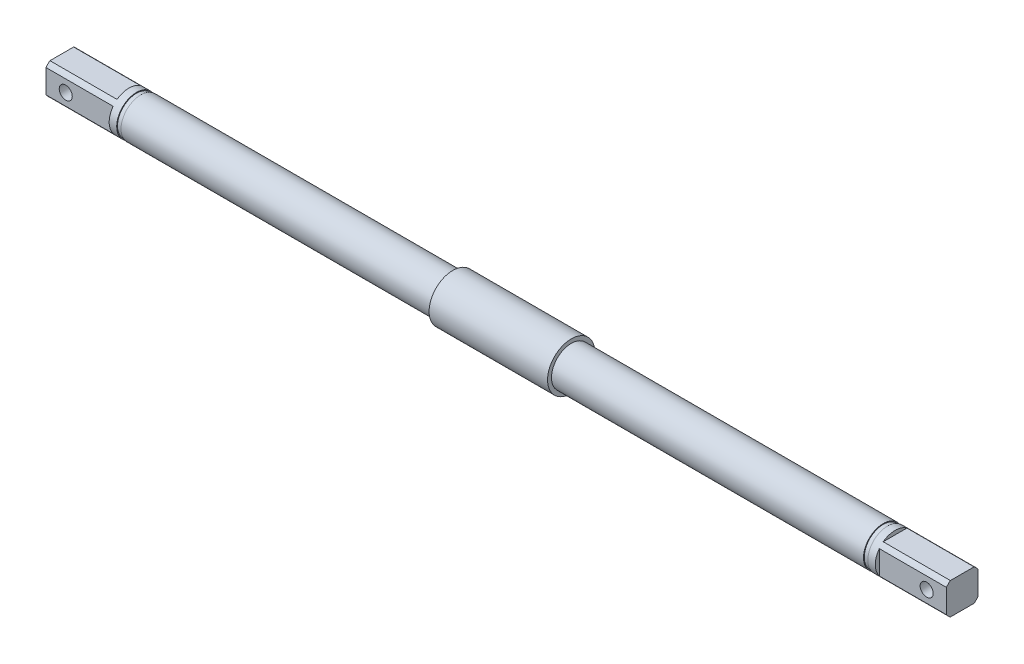
ISO-10303-21;
HEADER;
FILE_DESCRIPTION(('STEP AP214'),'2;1');
FILE_NAME('part.step','',(''),(''),'','','');
FILE_SCHEMA(('AUTOMOTIVE_DESIGN { 1 0 10303 214 1 1 1 1 }'));
ENDSEC;
DATA;
#1=APPLICATION_CONTEXT('core data for automotive mechanical design processes');
#2=APPLICATION_PROTOCOL_DEFINITION('international standard','automotive_design',2000,#1);
#3=PRODUCT_CONTEXT('',#1,'mechanical');
#4=PRODUCT('Part','Part','',(#3));
#5=PRODUCT_RELATED_PRODUCT_CATEGORY('part','',(#4));
#6=PRODUCT_DEFINITION_FORMATION('','',#4);
#7=PRODUCT_DEFINITION_CONTEXT('part definition',#1,'design');
#8=PRODUCT_DEFINITION('design','',#6,#7);
#9=PRODUCT_DEFINITION_SHAPE('','',#8);
#10=(LENGTH_UNIT() NAMED_UNIT(*) SI_UNIT(.MILLI.,.METRE.));
#11=(NAMED_UNIT(*) PLANE_ANGLE_UNIT() SI_UNIT($,.RADIAN.));
#12=(NAMED_UNIT(*) SI_UNIT($,.STERADIAN.) SOLID_ANGLE_UNIT());
#13=UNCERTAINTY_MEASURE_WITH_UNIT(LENGTH_MEASURE(1.E-05),#10,'distance_accuracy_value','');
#14=(GEOMETRIC_REPRESENTATION_CONTEXT(3) GLOBAL_UNCERTAINTY_ASSIGNED_CONTEXT((#13)) GLOBAL_UNIT_ASSIGNED_CONTEXT((#10,
#11,#12)) REPRESENTATION_CONTEXT('',''));
#15=CARTESIAN_POINT('',(0.,0.,0.));
#16=DIRECTION('',(0.,0.,1.));
#17=DIRECTION('',(1.,0.,0.));
#18=AXIS2_PLACEMENT_3D('',#15,#16,#17);
#19=CARTESIAN_POINT('',(-97.,4.00000000000007,4.));
#20=DIRECTION('',(0.,0.,-1.));
#21=DIRECTION('',(0.,1.,0.));
#22=AXIS2_PLACEMENT_3D('',#19,#20,#21);
#23=PLANE('',#22);
#24=DIRECTION('',(0.,-1.,0.));
#25=VECTOR('',#24,1.);
#26=CARTESIAN_POINT('',(-97.,4.00000000000007,4.));
#27=LINE('',#26,#25);
#28=CARTESIAN_POINT('',(-97.,2.99999999999997,4.));
#29=VERTEX_POINT('',#28);
#30=CARTESIAN_POINT('',(-97.,-2.99999999999983,4.));
#31=VERTEX_POINT('',#30);
#32=EDGE_CURVE('E333',#29,#31,#27,.T.);
#33=ORIENTED_EDGE('',*,*,#32,.F.);
#34=DIRECTION('',(-1.,0.,0.));
#35=VECTOR('',#34,1.);
#36=CARTESIAN_POINT('',(-114.,2.99999999999997,4.));
#37=LINE('',#36,#35);
#38=CARTESIAN_POINT('',(-114.,3.,4.));
#39=VERTEX_POINT('',#38);
#40=EDGE_CURVE('E176',#39,#29,#37,.F.);
#41=ORIENTED_EDGE('',*,*,#40,.F.);
#42=DIRECTION('',(0.,1.,0.));
#43=VECTOR('',#42,1.);
#44=CARTESIAN_POINT('',(-114.,5.00000000000003,4.));
#45=LINE('',#44,#43);
#46=CARTESIAN_POINT('',(-114.,-2.99999999999986,4.));
#47=VERTEX_POINT('',#46);
#48=EDGE_CURVE('E167',#47,#39,#45,.T.);
#49=ORIENTED_EDGE('',*,*,#48,.F.);
#50=DIRECTION('',(-1.,0.,0.));
#51=VECTOR('',#50,1.);
#52=CARTESIAN_POINT('',(-114.,-2.99999999999983,4.));
#53=LINE('',#52,#51);
#54=EDGE_CURVE('E207',#31,#47,#53,.T.);
#55=ORIENTED_EDGE('',*,*,#54,.F.);
#56=EDGE_LOOP('',(#33,#41,#49,#55));
#57=FACE_BOUND('',#56,.T.);
#58=CARTESIAN_POINT('',(-109.,0.,4.));
#59=DIRECTION('',(0.,0.,1.));
#60=DIRECTION('',(1.,0.,0.));
#61=AXIS2_PLACEMENT_3D('',#58,#59,#60);
#62=CIRCLE('',#61,1.64999999999998);
#63=CARTESIAN_POINT('',(-107.35,0.,4.));
#64=VERTEX_POINT('',#63);
#65=EDGE_CURVE('E318',#64,#64,#62,.T.);
#66=ORIENTED_EDGE('',*,*,#65,.F.);
#67=EDGE_LOOP('',(#66));
#68=FACE_BOUND('',#67,.T.);
#69=ADVANCED_FACE('F39',(#57,#68),#23,.F.);
#70=CARTESIAN_POINT('',(114.,0.,0.));
#71=DIRECTION('',(-1.,0.,0.));
#72=DIRECTION('',(0.,-1.,0.));
#73=AXIS2_PLACEMENT_3D('',#70,#71,#72);
#74=PLANE('',#73);
#75=DIRECTION('',(0.,1.,0.));
#76=VECTOR('',#75,1.);
#77=CARTESIAN_POINT('',(114.,4.00000000000007,-4.));
#78=LINE('',#77,#76);
#79=CARTESIAN_POINT('',(114.,-2.99999999999987,-4.));
#80=VERTEX_POINT('',#79);
#81=CARTESIAN_POINT('',(114.,3.00000000000001,-4.));
#82=VERTEX_POINT('',#81);
#83=EDGE_CURVE('E213',#80,#82,#78,.T.);
#84=ORIENTED_EDGE('',*,*,#83,.T.);
#85=CARTESIAN_POINT('',(114.,0.,0.));
#86=DIRECTION('',(-1.,0.,0.));
#87=DIRECTION('',(0.,-1.,0.));
#88=AXIS2_PLACEMENT_3D('',#85,#86,#87);
#89=CIRCLE('',#88,5.);
#90=CARTESIAN_POINT('',(114.,4.00000000000007,-2.99999999999994));
#91=VERTEX_POINT('',#90);
#92=EDGE_CURVE('E271',#91,#82,#89,.T.);
#93=ORIENTED_EDGE('',*,*,#92,.F.);
#94=DIRECTION('',(0.,0.,1.));
#95=VECTOR('',#94,1.);
#96=CARTESIAN_POINT('',(114.,4.00000000000007,4.));
#97=LINE('',#96,#95);
#98=CARTESIAN_POINT('',(114.,4.00000000000007,2.99999999999994));
#99=VERTEX_POINT('',#98);
#100=EDGE_CURVE('E226',#91,#99,#97,.T.);
#101=ORIENTED_EDGE('',*,*,#100,.T.);
#102=CARTESIAN_POINT('',(114.,3.00000000000001,4.));
#103=VERTEX_POINT('',#102);
#104=EDGE_CURVE('E187',#103,#99,#89,.T.);
#105=ORIENTED_EDGE('',*,*,#104,.F.);
#106=DIRECTION('',(0.,-1.,0.));
#107=VECTOR('',#106,1.);
#108=CARTESIAN_POINT('',(114.,4.00000000000007,4.));
#109=LINE('',#108,#107);
#110=CARTESIAN_POINT('',(114.,-2.99999999999987,4.));
#111=VERTEX_POINT('',#110);
#112=EDGE_CURVE('E229',#103,#111,#109,.T.);
#113=ORIENTED_EDGE('',*,*,#112,.T.);
#114=CARTESIAN_POINT('',(114.,-3.99999999999993,2.99999999999994));
#115=VERTEX_POINT('',#114);
#116=EDGE_CURVE('E182',#115,#111,#89,.T.);
#117=ORIENTED_EDGE('',*,*,#116,.F.);
#118=DIRECTION('',(0.,0.,-1.));
#119=VECTOR('',#118,1.);
#120=CARTESIAN_POINT('',(114.,-3.99999999999993,4.));
#121=LINE('',#120,#119);
#122=CARTESIAN_POINT('',(114.,-3.99999999999993,-2.99999999999994));
#123=VERTEX_POINT('',#122);
#124=EDGE_CURVE('E217',#115,#123,#121,.T.);
#125=ORIENTED_EDGE('',*,*,#124,.T.);
#126=EDGE_CURVE('E189',#80,#123,#89,.T.);
#127=ORIENTED_EDGE('',*,*,#126,.F.);
#128=EDGE_LOOP('',(#84,#93,#101,#105,#113,#117,#125,#127));
#129=FACE_BOUND('',#128,.T.);
#130=ADVANCED_FACE('F289',(#129),#74,.F.);
#131=CARTESIAN_POINT('',(-114.,0.,0.));
#132=DIRECTION('',(-1.,0.,0.));
#133=DIRECTION('',(0.,-1.,0.));
#134=AXIS2_PLACEMENT_3D('',#131,#132,#133);
#135=CYLINDRICAL_SURFACE('',#134,4.99999999999996);
#136=CARTESIAN_POINT('',(95.1,0.,0.));
#137=DIRECTION('',(-1.,0.,0.));
#138=DIRECTION('',(0.,-1.,0.));
#139=AXIS2_PLACEMENT_3D('',#136,#137,#138);
#140=CIRCLE('',#139,4.99999999999993);
#141=CARTESIAN_POINT('',(95.1,-4.99999999999986,0.));
#142=VERTEX_POINT('',#141);
#143=EDGE_CURVE('E266',#142,#142,#140,.T.);
#144=ORIENTED_EDGE('',*,*,#143,.F.);
#145=EDGE_LOOP('',(#144));
#146=FACE_BOUND('',#145,.T.);
#147=DIRECTION('',(-1.,0.,0.));
#148=VECTOR('',#147,1.);
#149=CARTESIAN_POINT('',(-114.,-2.99999999999987,-4.));
#150=LINE('',#149,#148);
#151=CARTESIAN_POINT('',(97.,-2.99999999999987,-4.));
#152=VERTEX_POINT('',#151);
#153=EDGE_CURVE('E168',#80,#152,#150,.T.);
#154=ORIENTED_EDGE('',*,*,#153,.F.);
#155=ORIENTED_EDGE('',*,*,#126,.T.);
#156=DIRECTION('',(-1.,0.,0.));
#157=VECTOR('',#156,1.);
#158=CARTESIAN_POINT('',(-114.,-3.99999999999993,-2.99999999999994));
#159=LINE('',#158,#157);
#160=CARTESIAN_POINT('',(97.,-3.99999999999993,-2.99999999999994));
#161=VERTEX_POINT('',#160);
#162=EDGE_CURVE('E304',#161,#123,#159,.F.);
#163=ORIENTED_EDGE('',*,*,#162,.F.);
#164=CARTESIAN_POINT('',(97.,0.,0.));
#165=DIRECTION('',(1.,0.,0.));
#166=DIRECTION('',(0.,1.,0.));
#167=AXIS2_PLACEMENT_3D('',#164,#165,#166);
#168=CIRCLE('',#167,4.99999999999996);
#169=CARTESIAN_POINT('',(97.,-3.99999999999993,2.99999999999994));
#170=VERTEX_POINT('',#169);
#171=EDGE_CURVE('E306',#170,#161,#168,.T.);
#172=ORIENTED_EDGE('',*,*,#171,.F.);
#173=DIRECTION('',(-1.,0.,0.));
#174=VECTOR('',#173,1.);
#175=CARTESIAN_POINT('',(-114.,-3.99999999999993,2.99999999999994));
#176=LINE('',#175,#174);
#177=EDGE_CURVE('E307',#115,#170,#176,.T.);
#178=ORIENTED_EDGE('',*,*,#177,.F.);
#179=ORIENTED_EDGE('',*,*,#116,.T.);
#180=DIRECTION('',(-1.,0.,0.));
#181=VECTOR('',#180,1.);
#182=CARTESIAN_POINT('',(-114.,-2.99999999999987,4.));
#183=LINE('',#182,#181);
#184=CARTESIAN_POINT('',(97.,-2.99999999999987,4.));
#185=VERTEX_POINT('',#184);
#186=EDGE_CURVE('E296',#185,#111,#183,.F.);
#187=ORIENTED_EDGE('',*,*,#186,.F.);
#188=CARTESIAN_POINT('',(97.,3.00000000000001,4.));
#189=VERTEX_POINT('',#188);
#190=EDGE_CURVE('E298',#189,#185,#168,.T.);
#191=ORIENTED_EDGE('',*,*,#190,.F.);
#192=DIRECTION('',(-1.,0.,0.));
#193=VECTOR('',#192,1.);
#194=CARTESIAN_POINT('',(-114.,3.00000000000001,4.));
#195=LINE('',#194,#193);
#196=EDGE_CURVE('E287',#103,#189,#195,.T.);
#197=ORIENTED_EDGE('',*,*,#196,.F.);
#198=ORIENTED_EDGE('',*,*,#104,.T.);
#199=DIRECTION('',(-1.,0.,0.));
#200=VECTOR('',#199,1.);
#201=CARTESIAN_POINT('',(-114.,4.00000000000007,2.99999999999994));
#202=LINE('',#201,#200);
#203=CARTESIAN_POINT('',(97.,4.00000000000007,2.99999999999994));
#204=VERTEX_POINT('',#203);
#205=EDGE_CURVE('E191',#204,#99,#202,.F.);
#206=ORIENTED_EDGE('',*,*,#205,.F.);
#207=CARTESIAN_POINT('',(97.,4.00000000000007,-2.99999999999994));
#208=VERTEX_POINT('',#207);
#209=EDGE_CURVE('E193',#208,#204,#168,.T.);
#210=ORIENTED_EDGE('',*,*,#209,.F.);
#211=DIRECTION('',(-1.,0.,0.));
#212=VECTOR('',#211,1.);
#213=CARTESIAN_POINT('',(-114.,4.00000000000007,-2.99999999999994));
#214=LINE('',#213,#212);
#215=EDGE_CURVE('E293',#91,#208,#214,.T.);
#216=ORIENTED_EDGE('',*,*,#215,.F.);
#217=ORIENTED_EDGE('',*,*,#92,.T.);
#218=DIRECTION('',(-1.,0.,0.));
#219=VECTOR('',#218,1.);
#220=CARTESIAN_POINT('',(-114.,3.00000000000001,-4.));
#221=LINE('',#220,#219);
#222=CARTESIAN_POINT('',(97.,3.00000000000001,-4.));
#223=VERTEX_POINT('',#222);
#224=EDGE_CURVE('E309',#223,#82,#221,.F.);
#225=ORIENTED_EDGE('',*,*,#224,.F.);
#226=EDGE_CURVE('E301',#152,#223,#168,.T.);
#227=ORIENTED_EDGE('',*,*,#226,.F.);
#228=EDGE_LOOP('',(#154,#155,#163,#172,#178,#179,#187,#191,#197,#198,#206,#210,#216,#217,#225,#227));
#229=FACE_BOUND('',#228,.T.);
#230=ADVANCED_FACE('F284',(#146,#229),#135,.T.);
#231=CARTESIAN_POINT('',(-114.,0.,0.));
#232=DIRECTION('',(-1.,0.,0.));
#233=DIRECTION('',(0.,-1.,0.));
#234=AXIS2_PLACEMENT_3D('',#231,#232,#233);
#235=CYLINDRICAL_SURFACE('',#234,4.99999999999994);
#236=CARTESIAN_POINT('',(-97.,0.,0.));
#237=DIRECTION('',(-1.,0.,0.));
#238=DIRECTION('',(0.,-1.,0.));
#239=AXIS2_PLACEMENT_3D('',#236,#237,#238);
#240=CIRCLE('',#239,4.99999999999994);
#241=CARTESIAN_POINT('',(-97.,2.99999999999997,-4.));
#242=VERTEX_POINT('',#241);
#243=CARTESIAN_POINT('',(-97.,-2.99999999999982,-4.));
#244=VERTEX_POINT('',#243);
#245=EDGE_CURVE('E12',#242,#244,#240,.T.);
#246=ORIENTED_EDGE('',*,*,#245,.F.);
#247=DIRECTION('',(-1.,0.,0.));
#248=VECTOR('',#247,1.);
#249=CARTESIAN_POINT('',(-114.,2.99999999999997,-4.));
#250=LINE('',#249,#248);
#251=CARTESIAN_POINT('',(-114.,3.,-4.));
#252=VERTEX_POINT('',#251);
#253=EDGE_CURVE('E205',#242,#252,#250,.T.);
#254=ORIENTED_EDGE('',*,*,#253,.T.);
#255=CARTESIAN_POINT('',(-114.,0.,0.));
#256=DIRECTION('',(-1.,0.,0.));
#257=DIRECTION('',(0.,-1.,0.));
#258=AXIS2_PLACEMENT_3D('',#255,#256,#257);
#259=CIRCLE('',#258,4.99999999999996);
#260=CARTESIAN_POINT('',(-114.,4.00000000000007,-2.99999999999992));
#261=VERTEX_POINT('',#260);
#262=EDGE_CURVE('E181',#261,#252,#259,.T.);
#263=ORIENTED_EDGE('',*,*,#262,.F.);
#264=DIRECTION('',(-1.,0.,0.));
#265=VECTOR('',#264,1.);
#266=CARTESIAN_POINT('',(-114.,4.00000000000007,-2.9999999999999));
#267=LINE('',#266,#265);
#268=CARTESIAN_POINT('',(-97.,4.00000000000007,-2.9999999999999));
#269=VERTEX_POINT('',#268);
#270=EDGE_CURVE('E65',#261,#269,#267,.F.);
#271=ORIENTED_EDGE('',*,*,#270,.T.);
#272=CARTESIAN_POINT('',(-97.,4.00000000000007,2.9999999999999));
#273=VERTEX_POINT('',#272);
#274=EDGE_CURVE('E48',#273,#269,#240,.T.);
#275=ORIENTED_EDGE('',*,*,#274,.F.);
#276=DIRECTION('',(-1.,0.,0.));
#277=VECTOR('',#276,1.);
#278=CARTESIAN_POINT('',(-114.,4.00000000000007,2.9999999999999));
#279=LINE('',#278,#277);
#280=CARTESIAN_POINT('',(-114.,4.00000000000007,2.99999999999992));
#281=VERTEX_POINT('',#280);
#282=EDGE_CURVE('E202',#273,#281,#279,.T.);
#283=ORIENTED_EDGE('',*,*,#282,.T.);
#284=EDGE_CURVE('E185',#39,#281,#259,.T.);
#285=ORIENTED_EDGE('',*,*,#284,.F.);
#286=ORIENTED_EDGE('',*,*,#40,.T.);
#287=EDGE_CURVE('E314',#31,#29,#240,.T.);
#288=ORIENTED_EDGE('',*,*,#287,.F.);
#289=ORIENTED_EDGE('',*,*,#54,.T.);
#290=CARTESIAN_POINT('',(-114.,-3.99999999999993,2.99999999999993));
#291=VERTEX_POINT('',#290);
#292=EDGE_CURVE('E184',#291,#47,#259,.T.);
#293=ORIENTED_EDGE('',*,*,#292,.F.);
#294=DIRECTION('',(-1.,0.,0.));
#295=VECTOR('',#294,1.);
#296=CARTESIAN_POINT('',(-114.,-3.99999999999993,2.9999999999999));
#297=LINE('',#296,#295);
#298=CARTESIAN_POINT('',(-97.,-3.99999999999993,2.9999999999999));
#299=VERTEX_POINT('',#298);
#300=EDGE_CURVE('E162',#291,#299,#297,.F.);
#301=ORIENTED_EDGE('',*,*,#300,.T.);
#302=CARTESIAN_POINT('',(-97.,-3.99999999999993,-2.9999999999999));
#303=VERTEX_POINT('',#302);
#304=EDGE_CURVE('E50',#303,#299,#240,.T.);
#305=ORIENTED_EDGE('',*,*,#304,.F.);
#306=DIRECTION('',(-1.,0.,0.));
#307=VECTOR('',#306,1.);
#308=CARTESIAN_POINT('',(-114.,-3.99999999999993,-2.9999999999999));
#309=LINE('',#308,#307);
#310=CARTESIAN_POINT('',(-114.,-3.99999999999993,-2.99999999999993));
#311=VERTEX_POINT('',#310);
#312=EDGE_CURVE('E159',#303,#311,#309,.T.);
#313=ORIENTED_EDGE('',*,*,#312,.T.);
#314=CARTESIAN_POINT('',(-114.,-2.99999999999985,-4.));
#315=VERTEX_POINT('',#314);
#316=EDGE_CURVE('E175',#315,#311,#259,.T.);
#317=ORIENTED_EDGE('',*,*,#316,.F.);
#318=DIRECTION('',(-1.,0.,0.));
#319=VECTOR('',#318,1.);
#320=CARTESIAN_POINT('',(-114.,-2.99999999999982,-4.));
#321=LINE('',#320,#319);
#322=EDGE_CURVE('E57',#315,#244,#321,.F.);
#323=ORIENTED_EDGE('',*,*,#322,.T.);
#324=EDGE_LOOP('',(#246,#254,#263,#271,#275,#283,#285,#286,#288,#289,#293,#301,#305,#313,#317,#323));
#325=FACE_BOUND('',#324,.T.);
#326=CARTESIAN_POINT('',(-95.1,0.,0.));
#327=DIRECTION('',(-1.,0.,0.));
#328=DIRECTION('',(0.,-1.,0.));
#329=AXIS2_PLACEMENT_3D('',#326,#327,#328);
#330=CIRCLE('',#329,4.99999999999992);
#331=CARTESIAN_POINT('',(-95.1,-4.99999999999985,0.));
#332=VERTEX_POINT('',#331);
#333=EDGE_CURVE('E223',#332,#332,#330,.T.);
#334=ORIENTED_EDGE('',*,*,#333,.T.);
#335=EDGE_LOOP('',(#334));
#336=FACE_BOUND('',#335,.T.);
#337=ADVANCED_FACE('F41',(#325,#336),#235,.T.);
#338=CARTESIAN_POINT('',(-114.,5.00000000000003,0.));
#339=DIRECTION('',(1.,0.,0.));
#340=DIRECTION('',(0.,1.,0.));
#341=AXIS2_PLACEMENT_3D('',#338,#339,#340);
#342=PLANE('',#341);
#343=ORIENTED_EDGE('',*,*,#262,.T.);
#344=DIRECTION('',(0.,-1.,0.));
#345=VECTOR('',#344,1.);
#346=CARTESIAN_POINT('',(-114.,5.00000000000003,-4.));
#347=LINE('',#346,#345);
#348=EDGE_CURVE('E180',#252,#315,#347,.T.);
#349=ORIENTED_EDGE('',*,*,#348,.T.);
#350=ORIENTED_EDGE('',*,*,#316,.T.);
#351=DIRECTION('',(0.,0.,1.));
#352=VECTOR('',#351,1.);
#353=CARTESIAN_POINT('',(-114.,-3.99999999999993,0.));
#354=LINE('',#353,#352);
#355=EDGE_CURVE('E155',#311,#291,#354,.T.);
#356=ORIENTED_EDGE('',*,*,#355,.T.);
#357=ORIENTED_EDGE('',*,*,#292,.T.);
#358=ORIENTED_EDGE('',*,*,#48,.T.);
#359=ORIENTED_EDGE('',*,*,#284,.T.);
#360=DIRECTION('',(0.,0.,-1.));
#361=VECTOR('',#360,1.);
#362=CARTESIAN_POINT('',(-114.,4.00000000000007,0.));
#363=LINE('',#362,#361);
#364=EDGE_CURVE('E196',#281,#261,#363,.T.);
#365=ORIENTED_EDGE('',*,*,#364,.T.);
#366=EDGE_LOOP('',(#343,#349,#350,#356,#357,#358,#359,#365));
#367=FACE_BOUND('',#366,.T.);
#368=ADVANCED_FACE('F179',(#367),#342,.F.);
#369=CARTESIAN_POINT('',(95.1,5.,0.));
#370=DIRECTION('',(1.,0.,0.));
#371=DIRECTION('',(0.,1.,0.));
#372=AXIS2_PLACEMENT_3D('',#369,#370,#371);
#373=PLANE('',#372);
#374=CARTESIAN_POINT('',(95.1,0.,0.));
#375=DIRECTION('',(-1.,0.,0.));
#376=DIRECTION('',(0.,-1.,0.));
#377=AXIS2_PLACEMENT_3D('',#374,#375,#376);
#378=CIRCLE('',#377,4.79999999999993);
#379=CARTESIAN_POINT('',(95.1,-4.79999999999986,0.));
#380=VERTEX_POINT('',#379);
#381=EDGE_CURVE('E263',#380,#380,#378,.T.);
#382=ORIENTED_EDGE('',*,*,#381,.F.);
#383=EDGE_LOOP('',(#382));
#384=FACE_BOUND('',#383,.T.);
#385=ORIENTED_EDGE('',*,*,#143,.T.);
#386=EDGE_LOOP('',(#385));
#387=FACE_BOUND('',#386,.T.);
#388=ADVANCED_FACE('F436',(#384,#387),#373,.F.);
#389=CARTESIAN_POINT('',(-114.,0.,0.));
#390=DIRECTION('',(-1.,0.,0.));
#391=DIRECTION('',(0.,-1.,0.));
#392=AXIS2_PLACEMENT_3D('',#389,#390,#391);
#393=CYLINDRICAL_SURFACE('',#392,4.79999999999993);
#394=CARTESIAN_POINT('',(94.,0.,0.));
#395=DIRECTION('',(-1.,0.,0.));
#396=DIRECTION('',(0.,-1.,0.));
#397=AXIS2_PLACEMENT_3D('',#394,#395,#396);
#398=CIRCLE('',#397,4.79999999999993);
#399=CARTESIAN_POINT('',(94.,-4.79999999999986,0.));
#400=VERTEX_POINT('',#399);
#401=EDGE_CURVE('E260',#400,#400,#398,.T.);
#402=ORIENTED_EDGE('',*,*,#401,.F.);
#403=EDGE_LOOP('',(#402));
#404=FACE_BOUND('',#403,.T.);
#405=ORIENTED_EDGE('',*,*,#381,.T.);
#406=EDGE_LOOP('',(#405));
#407=FACE_BOUND('',#406,.T.);
#408=ADVANCED_FACE('F432',(#404,#407),#393,.T.);
#409=CARTESIAN_POINT('',(94.,5.,0.));
#410=DIRECTION('',(-1.,0.,0.));
#411=DIRECTION('',(0.,-1.,0.));
#412=AXIS2_PLACEMENT_3D('',#409,#410,#411);
#413=PLANE('',#412);
#414=CARTESIAN_POINT('',(94.,0.,0.));
#415=DIRECTION('',(-1.,0.,0.));
#416=DIRECTION('',(0.,-1.,0.));
#417=AXIS2_PLACEMENT_3D('',#414,#415,#416);
#418=CIRCLE('',#417,4.99999999999993);
#419=CARTESIAN_POINT('',(94.,-4.99999999999986,0.));
#420=VERTEX_POINT('',#419);
#421=EDGE_CURVE('E257',#420,#420,#418,.T.);
#422=ORIENTED_EDGE('',*,*,#421,.F.);
#423=EDGE_LOOP('',(#422));
#424=FACE_BOUND('',#423,.T.);
#425=ORIENTED_EDGE('',*,*,#401,.T.);
#426=EDGE_LOOP('',(#425));
#427=FACE_BOUND('',#426,.T.);
#428=ADVANCED_FACE('F428',(#424,#427),#413,.F.);
#429=CARTESIAN_POINT('',(-114.,0.,0.));
#430=DIRECTION('',(-1.,0.,0.));
#431=DIRECTION('',(0.,-1.,0.));
#432=AXIS2_PLACEMENT_3D('',#429,#430,#431);
#433=CYLINDRICAL_SURFACE('',#432,4.99999999999995);
#434=CARTESIAN_POINT('',(15.,0.,0.));
#435=DIRECTION('',(-1.,0.,0.));
#436=DIRECTION('',(0.,-1.,0.));
#437=AXIS2_PLACEMENT_3D('',#434,#435,#436);
#438=CIRCLE('',#437,4.99999999999998);
#439=CARTESIAN_POINT('',(15.,-4.9999999999999,0.));
#440=VERTEX_POINT('',#439);
#441=EDGE_CURVE('E254',#440,#440,#438,.T.);
#442=ORIENTED_EDGE('',*,*,#441,.F.);
#443=EDGE_LOOP('',(#442));
#444=FACE_BOUND('',#443,.T.);
#445=ORIENTED_EDGE('',*,*,#421,.T.);
#446=EDGE_LOOP('',(#445));
#447=FACE_BOUND('',#446,.T.);
#448=ADVANCED_FACE('F424',(#444,#447),#433,.T.);
#449=CARTESIAN_POINT('',(15.,6.00000000000004,0.));
#450=DIRECTION('',(-1.,0.,0.));
#451=DIRECTION('',(0.,-1.,0.));
#452=AXIS2_PLACEMENT_3D('',#449,#450,#451);
#453=PLANE('',#452);
#454=CARTESIAN_POINT('',(15.,0.,0.));
#455=DIRECTION('',(-1.,0.,0.));
#456=DIRECTION('',(0.,-1.,0.));
#457=AXIS2_PLACEMENT_3D('',#454,#455,#456);
#458=CIRCLE('',#457,5.99999999999997);
#459=CARTESIAN_POINT('',(15.,-5.9999999999999,0.));
#460=VERTEX_POINT('',#459);
#461=EDGE_CURVE('E251',#460,#460,#458,.T.);
#462=ORIENTED_EDGE('',*,*,#461,.F.);
#463=EDGE_LOOP('',(#462));
#464=FACE_BOUND('',#463,.T.);
#465=ORIENTED_EDGE('',*,*,#441,.T.);
#466=EDGE_LOOP('',(#465));
#467=FACE_BOUND('',#466,.T.);
#468=ADVANCED_FACE('F420',(#464,#467),#453,.F.);
#469=CARTESIAN_POINT('',(-114.,0.,0.));
#470=DIRECTION('',(-1.,0.,0.));
#471=DIRECTION('',(0.,-1.,0.));
#472=AXIS2_PLACEMENT_3D('',#469,#470,#471);
#473=CYLINDRICAL_SURFACE('',#472,5.99999999999997);
#474=CARTESIAN_POINT('',(-15.,0.,0.));
#475=DIRECTION('',(-1.,0.,0.));
#476=DIRECTION('',(0.,-1.,0.));
#477=AXIS2_PLACEMENT_3D('',#474,#475,#476);
#478=CIRCLE('',#477,5.99999999999997);
#479=CARTESIAN_POINT('',(-15.,-5.9999999999999,0.));
#480=VERTEX_POINT('',#479);
#481=EDGE_CURVE('E248',#480,#480,#478,.T.);
#482=ORIENTED_EDGE('',*,*,#481,.F.);
#483=EDGE_LOOP('',(#482));
#484=FACE_BOUND('',#483,.T.);
#485=ORIENTED_EDGE('',*,*,#461,.T.);
#486=EDGE_LOOP('',(#485));
#487=FACE_BOUND('',#486,.T.);
#488=ADVANCED_FACE('F416',(#484,#487),#473,.T.);
#489=CARTESIAN_POINT('',(-15.,5.00000000000003,0.));
#490=DIRECTION('',(1.,0.,0.));
#491=DIRECTION('',(0.,1.,0.));
#492=AXIS2_PLACEMENT_3D('',#489,#490,#491);
#493=PLANE('',#492);
#494=CARTESIAN_POINT('',(-15.,0.,0.));
#495=DIRECTION('',(-1.,0.,0.));
#496=DIRECTION('',(0.,-1.,0.));
#497=AXIS2_PLACEMENT_3D('',#494,#495,#496);
#498=CIRCLE('',#497,4.99999999999996);
#499=CARTESIAN_POINT('',(-15.,-4.99999999999989,0.));
#500=VERTEX_POINT('',#499);
#501=EDGE_CURVE('E245',#500,#500,#498,.T.);
#502=ORIENTED_EDGE('',*,*,#501,.F.);
#503=EDGE_LOOP('',(#502));
#504=FACE_BOUND('',#503,.T.);
#505=ORIENTED_EDGE('',*,*,#481,.T.);
#506=EDGE_LOOP('',(#505));
#507=FACE_BOUND('',#506,.T.);
#508=ADVANCED_FACE('F412',(#504,#507),#493,.F.);
#509=CARTESIAN_POINT('',(-114.,0.,0.));
#510=DIRECTION('',(-1.,0.,0.));
#511=DIRECTION('',(0.,-1.,0.));
#512=AXIS2_PLACEMENT_3D('',#509,#510,#511);
#513=CYLINDRICAL_SURFACE('',#512,4.99999999999994);
#514=CARTESIAN_POINT('',(-94.,0.,0.));
#515=DIRECTION('',(-1.,0.,0.));
#516=DIRECTION('',(0.,-1.,0.));
#517=AXIS2_PLACEMENT_3D('',#514,#515,#516);
#518=CIRCLE('',#517,4.99999999999992);
#519=CARTESIAN_POINT('',(-94.,-4.99999999999985,0.));
#520=VERTEX_POINT('',#519);
#521=EDGE_CURVE('E242',#520,#520,#518,.T.);
#522=ORIENTED_EDGE('',*,*,#521,.F.);
#523=EDGE_LOOP('',(#522));
#524=FACE_BOUND('',#523,.T.);
#525=ORIENTED_EDGE('',*,*,#501,.T.);
#526=EDGE_LOOP('',(#525));
#527=FACE_BOUND('',#526,.T.);
#528=ADVANCED_FACE('F408',(#524,#527),#513,.T.);
#529=CARTESIAN_POINT('',(-94.,4.8,0.));
#530=DIRECTION('',(1.,0.,0.));
#531=DIRECTION('',(0.,1.,0.));
#532=AXIS2_PLACEMENT_3D('',#529,#530,#531);
#533=PLANE('',#532);
#534=CARTESIAN_POINT('',(-94.,0.,0.));
#535=DIRECTION('',(-1.,0.,0.));
#536=DIRECTION('',(0.,-1.,0.));
#537=AXIS2_PLACEMENT_3D('',#534,#535,#536);
#538=CIRCLE('',#537,4.79999999999993);
#539=CARTESIAN_POINT('',(-94.,-4.79999999999986,0.));
#540=VERTEX_POINT('',#539);
#541=EDGE_CURVE('E239',#540,#540,#538,.T.);
#542=ORIENTED_EDGE('',*,*,#541,.F.);
#543=EDGE_LOOP('',(#542));
#544=FACE_BOUND('',#543,.T.);
#545=ORIENTED_EDGE('',*,*,#521,.T.);
#546=EDGE_LOOP('',(#545));
#547=FACE_BOUND('',#546,.T.);
#548=ADVANCED_FACE('F404',(#544,#547),#533,.F.);
#549=CARTESIAN_POINT('',(-114.,0.,0.));
#550=DIRECTION('',(-1.,0.,0.));
#551=DIRECTION('',(0.,-1.,0.));
#552=AXIS2_PLACEMENT_3D('',#549,#550,#551);
#553=CYLINDRICAL_SURFACE('',#552,4.79999999999993);
#554=CARTESIAN_POINT('',(-95.1,0.,0.));
#555=DIRECTION('',(-1.,0.,0.));
#556=DIRECTION('',(0.,-1.,0.));
#557=AXIS2_PLACEMENT_3D('',#554,#555,#556);
#558=CIRCLE('',#557,4.79999999999993);
#559=CARTESIAN_POINT('',(-95.1,-4.79999999999986,0.));
#560=VERTEX_POINT('',#559);
#561=EDGE_CURVE('E236',#560,#560,#558,.T.);
#562=ORIENTED_EDGE('',*,*,#561,.F.);
#563=EDGE_LOOP('',(#562));
#564=FACE_BOUND('',#563,.T.);
#565=ORIENTED_EDGE('',*,*,#541,.T.);
#566=EDGE_LOOP('',(#565));
#567=FACE_BOUND('',#566,.T.);
#568=ADVANCED_FACE('F400',(#564,#567),#553,.T.);
#569=CARTESIAN_POINT('',(-95.1,4.99999999999999,0.));
#570=DIRECTION('',(-1.,0.,0.));
#571=DIRECTION('',(0.,-1.,0.));
#572=AXIS2_PLACEMENT_3D('',#569,#570,#571);
#573=PLANE('',#572);
#574=ORIENTED_EDGE('',*,*,#333,.F.);
#575=EDGE_LOOP('',(#574));
#576=FACE_BOUND('',#575,.T.);
#577=ORIENTED_EDGE('',*,*,#561,.T.);
#578=EDGE_LOOP('',(#577));
#579=FACE_BOUND('',#578,.T.);
#580=ADVANCED_FACE('F397',(#576,#579),#573,.F.);
#581=CARTESIAN_POINT('',(97.,4.00000000000007,4.));
#582=DIRECTION('',(0.,1.,0.));
#583=DIRECTION('',(-1.,0.,0.));
#584=AXIS2_PLACEMENT_3D('',#581,#582,#583);
#585=PLANE('',#584);
#586=ORIENTED_EDGE('',*,*,#215,.T.);
#587=DIRECTION('',(0.,0.,1.));
#588=VECTOR('',#587,1.);
#589=CARTESIAN_POINT('',(97.,4.00000000000007,4.));
#590=LINE('',#589,#588);
#591=EDGE_CURVE('E216',#208,#204,#590,.T.);
#592=ORIENTED_EDGE('',*,*,#591,.T.);
#593=ORIENTED_EDGE('',*,*,#205,.T.);
#594=ORIENTED_EDGE('',*,*,#100,.F.);
#595=EDGE_LOOP('',(#586,#592,#593,#594));
#596=FACE_BOUND('',#595,.T.);
#597=ADVANCED_FACE('F292',(#596),#585,.T.);
#598=CARTESIAN_POINT('',(97.,0.,0.));
#599=DIRECTION('',(1.,0.,0.));
#600=DIRECTION('',(0.,1.,0.));
#601=AXIS2_PLACEMENT_3D('',#598,#599,#600);
#602=PLANE('',#601);
#603=ORIENTED_EDGE('',*,*,#209,.T.);
#604=ORIENTED_EDGE('',*,*,#591,.F.);
#605=EDGE_LOOP('',(#603,#604));
#606=FACE_BOUND('',#605,.T.);
#607=ADVANCED_FACE('F386',(#606),#602,.T.);
#608=CARTESIAN_POINT('',(97.,4.00000000000007,4.));
#609=DIRECTION('',(0.,0.,1.));
#610=DIRECTION('',(0.,-1.,0.));
#611=AXIS2_PLACEMENT_3D('',#608,#609,#610);
#612=PLANE('',#611);
#613=CARTESIAN_POINT('',(109.,0.,4.));
#614=DIRECTION('',(0.,0.,1.));
#615=DIRECTION('',(1.,0.,0.));
#616=AXIS2_PLACEMENT_3D('',#613,#614,#615);
#617=CIRCLE('',#616,1.64999999999998);
#618=CARTESIAN_POINT('',(110.65,0.,4.));
#619=VERTEX_POINT('',#618);
#620=EDGE_CURVE('E329',#619,#619,#617,.T.);
#621=ORIENTED_EDGE('',*,*,#620,.F.);
#622=EDGE_LOOP('',(#621));
#623=FACE_BOUND('',#622,.T.);
#624=ORIENTED_EDGE('',*,*,#196,.T.);
#625=DIRECTION('',(0.,-1.,0.));
#626=VECTOR('',#625,1.);
#627=CARTESIAN_POINT('',(97.,4.00000000000007,4.));
#628=LINE('',#627,#626);
#629=EDGE_CURVE('E219',#189,#185,#628,.T.);
#630=ORIENTED_EDGE('',*,*,#629,.T.);
#631=ORIENTED_EDGE('',*,*,#186,.T.);
#632=ORIENTED_EDGE('',*,*,#112,.F.);
#633=EDGE_LOOP('',(#624,#630,#631,#632));
#634=FACE_BOUND('',#633,.T.);
#635=ADVANCED_FACE('F395',(#623,#634),#612,.T.);
#636=ORIENTED_EDGE('',*,*,#190,.T.);
#637=ORIENTED_EDGE('',*,*,#629,.F.);
#638=EDGE_LOOP('',(#636,#637));
#639=FACE_BOUND('',#638,.T.);
#640=ADVANCED_FACE('F391',(#639),#602,.T.);
#641=CARTESIAN_POINT('',(97.,-3.99999999999993,4.));
#642=DIRECTION('',(0.,-1.,0.));
#643=DIRECTION('',(1.,0.,0.));
#644=AXIS2_PLACEMENT_3D('',#641,#642,#643);
#645=PLANE('',#644);
#646=ORIENTED_EDGE('',*,*,#177,.T.);
#647=DIRECTION('',(0.,0.,-1.));
#648=VECTOR('',#647,1.);
#649=CARTESIAN_POINT('',(97.,-3.99999999999993,4.));
#650=LINE('',#649,#648);
#651=EDGE_CURVE('E221',#170,#161,#650,.T.);
#652=ORIENTED_EDGE('',*,*,#651,.T.);
#653=ORIENTED_EDGE('',*,*,#162,.T.);
#654=ORIENTED_EDGE('',*,*,#124,.F.);
#655=EDGE_LOOP('',(#646,#652,#653,#654));
#656=FACE_BOUND('',#655,.T.);
#657=ADVANCED_FACE('F394',(#656),#645,.T.);
#658=ORIENTED_EDGE('',*,*,#171,.T.);
#659=ORIENTED_EDGE('',*,*,#651,.F.);
#660=EDGE_LOOP('',(#658,#659));
#661=FACE_BOUND('',#660,.T.);
#662=ADVANCED_FACE('F383',(#661),#602,.T.);
#663=ORIENTED_EDGE('',*,*,#226,.T.);
#664=DIRECTION('',(0.,1.,0.));
#665=VECTOR('',#664,1.);
#666=CARTESIAN_POINT('',(97.,4.00000000000007,-4.));
#667=LINE('',#666,#665);
#668=EDGE_CURVE('E214',#152,#223,#667,.T.);
#669=ORIENTED_EDGE('',*,*,#668,.F.);
#670=EDGE_LOOP('',(#663,#669));
#671=FACE_BOUND('',#670,.T.);
#672=ADVANCED_FACE('F377',(#671),#602,.T.);
#673=CARTESIAN_POINT('',(97.,4.00000000000007,-4.));
#674=DIRECTION('',(0.,0.,-1.));
#675=DIRECTION('',(0.,1.,0.));
#676=AXIS2_PLACEMENT_3D('',#673,#674,#675);
#677=PLANE('',#676);
#678=CARTESIAN_POINT('',(109.,0.,-4.));
#679=DIRECTION('',(0.,0.,-1.));
#680=DIRECTION('',(0.,1.,0.));
#681=AXIS2_PLACEMENT_3D('',#678,#679,#680);
#682=CIRCLE('',#681,1.64999999999998);
#683=CARTESIAN_POINT('',(109.,1.64999999999998,-4.));
#684=VERTEX_POINT('',#683);
#685=EDGE_CURVE('E43',#684,#684,#682,.T.);
#686=ORIENTED_EDGE('',*,*,#685,.F.);
#687=EDGE_LOOP('',(#686));
#688=FACE_BOUND('',#687,.T.);
#689=ORIENTED_EDGE('',*,*,#153,.T.);
#690=ORIENTED_EDGE('',*,*,#668,.T.);
#691=ORIENTED_EDGE('',*,*,#224,.T.);
#692=ORIENTED_EDGE('',*,*,#83,.F.);
#693=EDGE_LOOP('',(#689,#690,#691,#692));
#694=FACE_BOUND('',#693,.T.);
#695=ADVANCED_FACE('F373',(#688,#694),#677,.T.);
#696=CARTESIAN_POINT('',(-97.,-3.99999999999993,4.));
#697=DIRECTION('',(0.,1.,0.));
#698=DIRECTION('',(-1.,0.,0.));
#699=AXIS2_PLACEMENT_3D('',#696,#697,#698);
#700=PLANE('',#699);
#701=DIRECTION('',(0.,0.,-1.));
#702=VECTOR('',#701,1.);
#703=CARTESIAN_POINT('',(-97.,-3.99999999999993,4.));
#704=LINE('',#703,#702);
#705=EDGE_CURVE('E322',#299,#303,#704,.T.);
#706=ORIENTED_EDGE('',*,*,#705,.F.);
#707=ORIENTED_EDGE('',*,*,#300,.F.);
#708=ORIENTED_EDGE('',*,*,#355,.F.);
#709=ORIENTED_EDGE('',*,*,#312,.F.);
#710=EDGE_LOOP('',(#706,#707,#708,#709));
#711=FACE_BOUND('',#710,.T.);
#712=ADVANCED_FACE('F158',(#711),#700,.F.);
#713=CARTESIAN_POINT('',(-97.,0.,0.));
#714=DIRECTION('',(-1.,0.,0.));
#715=DIRECTION('',(0.,-1.,0.));
#716=AXIS2_PLACEMENT_3D('',#713,#714,#715);
#717=PLANE('',#716);
#718=ORIENTED_EDGE('',*,*,#304,.T.);
#719=ORIENTED_EDGE('',*,*,#705,.T.);
#720=EDGE_LOOP('',(#718,#719));
#721=FACE_BOUND('',#720,.T.);
#722=ADVANCED_FACE('F353',(#721),#717,.T.);
#723=ORIENTED_EDGE('',*,*,#287,.T.);
#724=ORIENTED_EDGE('',*,*,#32,.T.);
#725=EDGE_LOOP('',(#723,#724));
#726=FACE_BOUND('',#725,.T.);
#727=ADVANCED_FACE('F344',(#726),#717,.T.);
#728=CARTESIAN_POINT('',(-97.,4.00000000000007,4.));
#729=DIRECTION('',(0.,-1.,0.));
#730=DIRECTION('',(1.,0.,0.));
#731=AXIS2_PLACEMENT_3D('',#728,#729,#730);
#732=PLANE('',#731);
#733=DIRECTION('',(0.,0.,1.));
#734=VECTOR('',#733,1.);
#735=CARTESIAN_POINT('',(-97.,4.00000000000007,4.));
#736=LINE('',#735,#734);
#737=EDGE_CURVE('E336',#269,#273,#736,.T.);
#738=ORIENTED_EDGE('',*,*,#737,.F.);
#739=ORIENTED_EDGE('',*,*,#270,.F.);
#740=ORIENTED_EDGE('',*,*,#364,.F.);
#741=ORIENTED_EDGE('',*,*,#282,.F.);
#742=EDGE_LOOP('',(#738,#739,#740,#741));
#743=FACE_BOUND('',#742,.T.);
#744=ADVANCED_FACE('F347',(#743),#732,.F.);
#745=ORIENTED_EDGE('',*,*,#274,.T.);
#746=ORIENTED_EDGE('',*,*,#737,.T.);
#747=EDGE_LOOP('',(#745,#746));
#748=FACE_BOUND('',#747,.T.);
#749=ADVANCED_FACE('F346',(#748),#717,.T.);
#750=ORIENTED_EDGE('',*,*,#245,.T.);
#751=DIRECTION('',(0.,1.,0.));
#752=VECTOR('',#751,1.);
#753=CARTESIAN_POINT('',(-97.,4.00000000000007,-4.));
#754=LINE('',#753,#752);
#755=EDGE_CURVE('E317',#244,#242,#754,.T.);
#756=ORIENTED_EDGE('',*,*,#755,.T.);
#757=EDGE_LOOP('',(#750,#756));
#758=FACE_BOUND('',#757,.T.);
#759=ADVANCED_FACE('F350',(#758),#717,.T.);
#760=CARTESIAN_POINT('',(-97.,4.00000000000007,-4.));
#761=DIRECTION('',(0.,0.,1.));
#762=DIRECTION('',(0.,-1.,0.));
#763=AXIS2_PLACEMENT_3D('',#760,#761,#762);
#764=PLANE('',#763);
#765=CARTESIAN_POINT('',(-109.,0.,-4.));
#766=DIRECTION('',(0.,0.,1.));
#767=DIRECTION('',(0.,-1.,0.));
#768=AXIS2_PLACEMENT_3D('',#765,#766,#767);
#769=CIRCLE('',#768,1.64999999999998);
#770=CARTESIAN_POINT('',(-109.,-1.64999999999998,-4.));
#771=VERTEX_POINT('',#770);
#772=EDGE_CURVE('E315',#771,#771,#769,.T.);
#773=ORIENTED_EDGE('',*,*,#772,.T.);
#774=EDGE_LOOP('',(#773));
#775=FACE_BOUND('',#774,.T.);
#776=ORIENTED_EDGE('',*,*,#755,.F.);
#777=ORIENTED_EDGE('',*,*,#322,.F.);
#778=ORIENTED_EDGE('',*,*,#348,.F.);
#779=ORIENTED_EDGE('',*,*,#253,.F.);
#780=EDGE_LOOP('',(#776,#777,#778,#779));
#781=FACE_BOUND('',#780,.T.);
#782=ADVANCED_FACE('F348',(#775,#781),#764,.F.);
#783=CARTESIAN_POINT('',(-109.,0.,4.));
#784=DIRECTION('',(0.,0.,1.));
#785=DIRECTION('',(1.,0.,0.));
#786=AXIS2_PLACEMENT_3D('',#783,#784,#785);
#787=CYLINDRICAL_SURFACE('',#786,1.64999999999998);
#788=ORIENTED_EDGE('',*,*,#65,.T.);
#789=EDGE_LOOP('',(#788));
#790=FACE_BOUND('',#789,.T.);
#791=ORIENTED_EDGE('',*,*,#772,.F.);
#792=EDGE_LOOP('',(#791));
#793=FACE_BOUND('',#792,.T.);
#794=ADVANCED_FACE('F358',(#790,#793),#787,.F.);
#795=CARTESIAN_POINT('',(109.,0.,4.));
#796=DIRECTION('',(0.,0.,1.));
#797=DIRECTION('',(1.,0.,0.));
#798=AXIS2_PLACEMENT_3D('',#795,#796,#797);
#799=CYLINDRICAL_SURFACE('',#798,1.64999999999998);
#800=ORIENTED_EDGE('',*,*,#685,.T.);
#801=EDGE_LOOP('',(#800));
#802=FACE_BOUND('',#801,.T.);
#803=ORIENTED_EDGE('',*,*,#620,.T.);
#804=EDGE_LOOP('',(#803));
#805=FACE_BOUND('',#804,.T.);
#806=ADVANCED_FACE('F603',(#802,#805),#799,.F.);
#807=CLOSED_SHELL('',(#69,#130,#230,#337,#368,#388,#408,#428,#448,#468,#488,#508,#528,#548,#568,
#580,#597,#607,#635,#640,#657,#662,#672,#695,#712,#722,#727,#744,#749,#759,#782,#794,#806));
#808=MANIFOLD_SOLID_BREP('B2',#807);
#809=ADVANCED_BREP_SHAPE_REPRESENTATION('',(#18,#808),#14);
#810=SHAPE_DEFINITION_REPRESENTATION(#9,#809);
ENDSEC;
END-ISO-10303-21;
